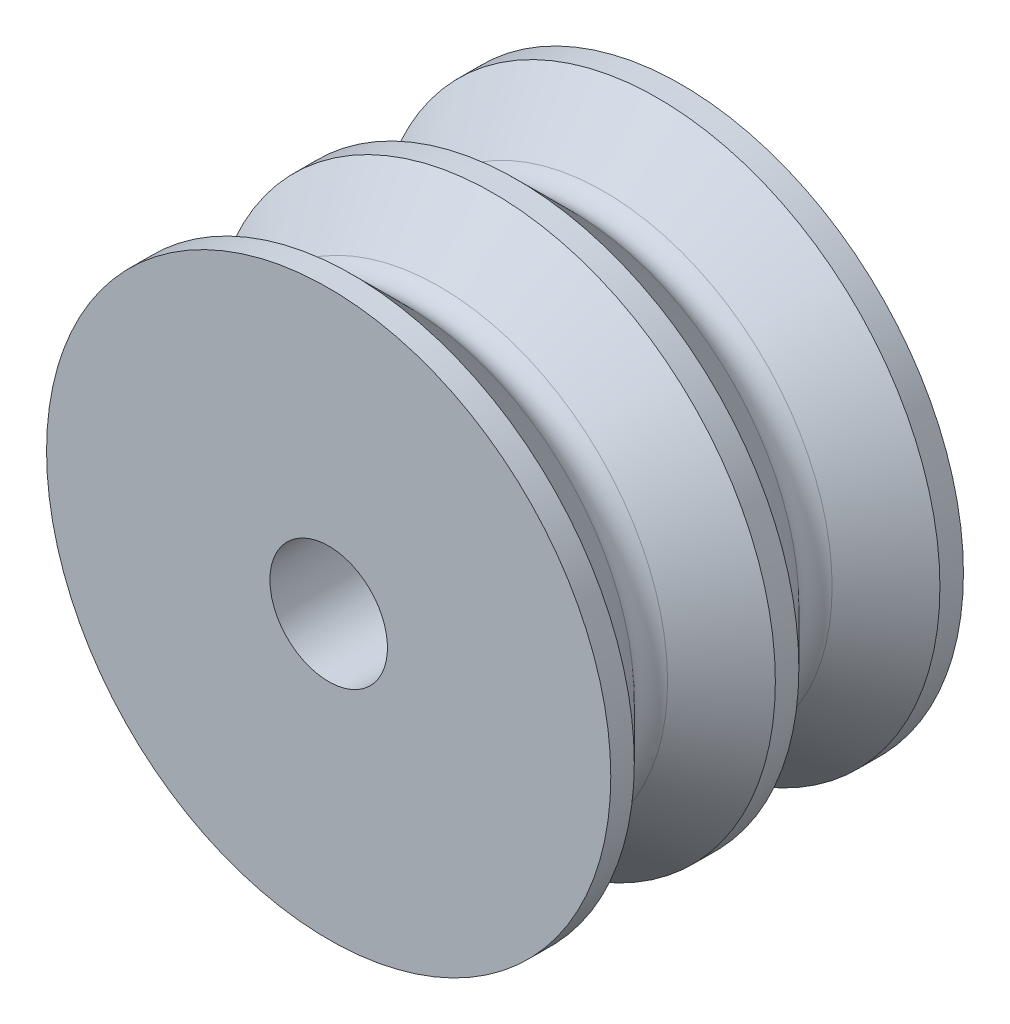
ISO-10303-21;
HEADER;
FILE_DESCRIPTION(('STEP AP214'),'2;1');
FILE_NAME('part.step','',(''),(''),'','','');
FILE_SCHEMA(('AUTOMOTIVE_DESIGN { 1 0 10303 214 1 1 1 1 }'));
ENDSEC;
DATA;
#1=APPLICATION_CONTEXT('core data for automotive mechanical design processes');
#2=APPLICATION_PROTOCOL_DEFINITION('international standard','automotive_design',2000,#1);
#3=PRODUCT_CONTEXT('',#1,'mechanical');
#4=PRODUCT('Part','Part','',(#3));
#5=PRODUCT_RELATED_PRODUCT_CATEGORY('part','',(#4));
#6=PRODUCT_DEFINITION_FORMATION('','',#4);
#7=PRODUCT_DEFINITION_CONTEXT('part definition',#1,'design');
#8=PRODUCT_DEFINITION('design','',#6,#7);
#9=PRODUCT_DEFINITION_SHAPE('','',#8);
#10=(LENGTH_UNIT() NAMED_UNIT(*) SI_UNIT(.MILLI.,.METRE.));
#11=(NAMED_UNIT(*) PLANE_ANGLE_UNIT() SI_UNIT($,.RADIAN.));
#12=(NAMED_UNIT(*) SI_UNIT($,.STERADIAN.) SOLID_ANGLE_UNIT());
#13=UNCERTAINTY_MEASURE_WITH_UNIT(LENGTH_MEASURE(1.E-05),#10,'distance_accuracy_value','');
#14=(GEOMETRIC_REPRESENTATION_CONTEXT(3) GLOBAL_UNCERTAINTY_ASSIGNED_CONTEXT((#13)) GLOBAL_UNIT_ASSIGNED_CONTEXT((#10,
#11,#12)) REPRESENTATION_CONTEXT('',''));
#15=CARTESIAN_POINT('',(0.,0.,0.));
#16=DIRECTION('',(0.,0.,1.));
#17=DIRECTION('',(1.,0.,0.));
#18=AXIS2_PLACEMENT_3D('',#15,#16,#17);
#19=CARTESIAN_POINT('',(-3.46389583683049E-13,-148.999797701156,372.300000000001));
#20=DIRECTION('',(0.,0.,1.));
#21=DIRECTION('',(1.,0.,0.));
#22=AXIS2_PLACEMENT_3D('',#19,#20,#21);
#23=PLANE('',#22);
#24=CARTESIAN_POINT('',(-3.46389583683049E-13,-148.999797701156,372.300000000001));
#25=DIRECTION('',(0.,0.,-1.));
#26=DIRECTION('',(-1.,0.,0.));
#27=AXIS2_PLACEMENT_3D('',#24,#25,#26);
#28=CIRCLE('',#27,0.999999999999995);
#29=CARTESIAN_POINT('',(-0.785683126104291,-148.381168551054,372.300000000001));
#30=VERTEX_POINT('',#29);
#31=CARTESIAN_POINT('',(0.785683126103598,-148.381168551054,372.300000000001));
#32=VERTEX_POINT('',#31);
#33=EDGE_CURVE('E55',#30,#32,#28,.T.);
#34=ORIENTED_EDGE('',*,*,#33,.T.);
#35=CARTESIAN_POINT('',(-3.46389583683049E-13,-138.999797701156,372.300000000001));
#36=DIRECTION('',(0.,0.,1.));
#37=DIRECTION('',(1.,0.,0.));
#38=AXIS2_PLACEMENT_3D('',#35,#36,#37);
#39=CIRCLE('',#38,9.4142135623731);
#40=EDGE_CURVE('E17',#30,#32,#39,.T.);
#41=ORIENTED_EDGE('',*,*,#40,.F.);
#42=EDGE_LOOP('',(#34,#41));
#43=FACE_BOUND('',#42,.T.);
#44=ADVANCED_FACE('F14',(#43),#23,.F.);
#45=CARTESIAN_POINT('',(-3.46389583683049E-13,-148.999797701156,365.300000000001));
#46=DIRECTION('',(0.,0.,1.));
#47=DIRECTION('',(1.,0.,0.));
#48=AXIS2_PLACEMENT_3D('',#45,#46,#47);
#49=PLANE('',#48);
#50=CARTESIAN_POINT('',(-3.46389583683049E-13,-138.999797701156,365.300000000001));
#51=DIRECTION('',(0.,0.,-1.));
#52=DIRECTION('',(-1.,0.,0.));
#53=AXIS2_PLACEMENT_3D('',#50,#51,#52);
#54=CIRCLE('',#53,9.4142135623731);
#55=CARTESIAN_POINT('',(-0.785683126104402,-148.381168551054,365.300000000001));
#56=VERTEX_POINT('',#55);
#57=CARTESIAN_POINT('',(0.785683126103598,-148.381168551054,365.300000000001));
#58=VERTEX_POINT('',#57);
#59=EDGE_CURVE('E50',#56,#58,#54,.F.);
#60=ORIENTED_EDGE('',*,*,#59,.T.);
#61=CARTESIAN_POINT('',(-3.46389583683049E-13,-148.999797701156,365.300000000001));
#62=DIRECTION('',(0.,0.,-1.));
#63=DIRECTION('',(-1.,0.,0.));
#64=AXIS2_PLACEMENT_3D('',#61,#62,#63);
#65=CIRCLE('',#64,0.999999999999995);
#66=EDGE_CURVE('E53',#58,#56,#65,.F.);
#67=ORIENTED_EDGE('',*,*,#66,.T.);
#68=EDGE_LOOP('',(#60,#67));
#69=FACE_BOUND('',#68,.T.);
#70=ADVANCED_FACE('F52',(#69),#49,.T.);
#71=CARTESIAN_POINT('',(-3.46077333457373E-13,-138.999797701156,369.300000000001));
#72=DIRECTION('',(0.,0.,-1.));
#73=DIRECTION('',(-1.,0.,0.));
#74=AXIS2_PLACEMENT_3D('',#71,#72,#73);
#75=CONICAL_SURFACE('',#74,12.,0.785398163397456);
#76=CARTESIAN_POINT('',(-3.46389583683049E-13,-138.999797701156,369.300000000001));
#77=DIRECTION('',(0.,0.,1.));
#78=DIRECTION('',(1.,0.,0.));
#79=AXIS2_PLACEMENT_3D('',#76,#77,#78);
#80=CIRCLE('',#79,12.);
#81=CARTESIAN_POINT('',(11.9999999999997,-138.999797701156,369.300000000001));
#82=VERTEX_POINT('',#81);
#83=EDGE_CURVE('E123',#82,#82,#80,.F.);
#84=ORIENTED_EDGE('',*,*,#83,.F.);
#85=EDGE_LOOP('',(#84));
#86=FACE_BOUND('',#85,.T.);
#87=CARTESIAN_POINT('',(0.940929009533424,-148.661193804224,371.592893218815));
#88=CARTESIAN_POINT('',(0.950761675392865,-148.688529687142,371.564732031432));
#89=CARTESIAN_POINT('',(0.959355090491101,-148.716135294409,371.536416572957));
#90=CARTESIAN_POINT('',(0.97408392329677,-148.771782886139,371.47958712578));
#91=CARTESIAN_POINT('',(0.980219849285714,-148.799824779118,371.451073179374));
#92=CARTESIAN_POINT('',(0.995025110040918,-148.884740782645,371.365104287514));
#93=CARTESIAN_POINT('',(0.999997028279216,-148.942138636444,371.30749700576));
#94=CARTESIAN_POINT('',(1.00000385578815,-149.07460997374,371.175683757575));
#95=CARTESIAN_POINT('',(0.99164254044308,-149.149861992266,371.101638175359));
#96=CARTESIAN_POINT('',(0.957234282382609,-149.299043058799,370.956395365391));
#97=CARTESIAN_POINT('',(0.931215074885569,-149.372973995201,370.885193855892));
#98=CARTESIAN_POINT('',(0.870678942944549,-149.494817621206,370.768965000672));
#99=CARTESIAN_POINT('',(0.841100603583893,-149.543845625449,370.722526376953));
#100=CARTESIAN_POINT('',(0.771855551009822,-149.63827777527,370.633624631573));
#101=CARTESIAN_POINT('',(0.732204389963432,-149.683687366865,370.591155518134));
#102=CARTESIAN_POINT('',(0.652676077545911,-149.758929039869,370.521152201862));
#103=CARTESIAN_POINT('',(0.614961785277175,-149.789937928269,370.492432925167));
#104=CARTESIAN_POINT('',(0.533236813824736,-149.847228845348,370.439552517499));
#105=CARTESIAN_POINT('',(0.489233917149894,-149.873516627244,370.415385836874));
#106=CARTESIAN_POINT('',(0.403991039101225,-149.915559197236,370.376835028246));
#107=CARTESIAN_POINT('',(0.363714582857212,-149.932360862634,370.361470328566));
#108=CARTESIAN_POINT('',(0.279930645422418,-149.960834504052,370.335470556928));
#109=CARTESIAN_POINT('',(0.236425090877602,-149.972509510592,370.324832690755));
#110=CARTESIAN_POINT('',(0.147014507445305,-149.989985308305,370.308921005338));
#111=CARTESIAN_POINT('',(0.101097420491732,-149.995752883759,370.303677516342));
#112=CARTESIAN_POINT('',(0.00861514879702178,-150.000831039736,370.299060362058));
#113=CARTESIAN_POINT('',(-0.0379498280568912,-150.000143645825,370.299684855399));
#114=CARTESIAN_POINT('',(-0.125764994496966,-149.99274433444,370.306413635611));
#115=CARTESIAN_POINT('',(-0.167105725796102,-149.986600461235,370.312001246583));
#116=CARTESIAN_POINT('',(-0.247887607092078,-149.969466390868,370.32760581542));
#117=CARTESIAN_POINT('',(-0.287328595238057,-149.95847578159,370.337623149942));
#118=CARTESIAN_POINT('',(-0.365027953774319,-149.931736879088,370.362041454038));
#119=CARTESIAN_POINT('',(-0.403175767493253,-149.915815732658,370.37660186211));
#120=CARTESIAN_POINT('',(-0.476000591185597,-149.880178549059,370.409275300227));
#121=CARTESIAN_POINT('',(-0.51067564322595,-149.860460389249,370.427390317509));
#122=CARTESIAN_POINT('',(-0.591934999932369,-149.80784557463,370.475870172796));
#123=CARTESIAN_POINT('',(-0.636328263729549,-149.773144495733,370.507960713314));
#124=CARTESIAN_POINT('',(-0.716914996099688,-149.699112690724,370.576777926564));
#125=CARTESIAN_POINT('',(-0.75309023809793,-149.659771962188,370.613514628563));
#126=CARTESIAN_POINT('',(-0.828719700674534,-149.563834224479,370.703614290354));
#127=CARTESIAN_POINT('',(-0.864966272956031,-149.505981495431,370.758327341144));
#128=CARTESIAN_POINT('',(-0.924248808261542,-149.387319345819,370.871498182804));
#129=CARTESIAN_POINT('',(-0.947269293385065,-149.32650655109,370.92996027247));
#130=CARTESIAN_POINT('',(-0.981479395886536,-149.202173816975,371.05054892856));
#131=CARTESIAN_POINT('',(-0.992361541863812,-149.138624140498,371.112730412019));
#132=CARTESIAN_POINT('',(-1.0019495264297,-149.011713984346,371.238079262454));
#133=CARTESIAN_POINT('',(-1.00066720235403,-148.948353380746,371.301245611287));
#134=CARTESIAN_POINT('',(-0.989089914093273,-148.847576817276,371.402674351908));
#135=CARTESIAN_POINT('',(-0.982529952804783,-148.80973866182,371.440980396663));
#136=CARTESIAN_POINT('',(-0.965022107847766,-148.734839164906,371.517245322683));
#137=CARTESIAN_POINT('',(-0.954079997857527,-148.697776868566,371.555204593791));
#138=CARTESIAN_POINT('',(-0.94092900953411,-148.661193804224,371.592893218815));
#139=B_SPLINE_CURVE_WITH_KNOTS('',3,(#87,#88,#89,#90,#91,#92,#93,#94,#95,#96,#97,#98,#99,#100,
#101,#102,#103,#104,#105,#106,#107,#108,#109,#110,#111,#112,#113,#114,#115,#116,#117,#118,#119,
#120,#121,#122,#123,#124,#125,#126,#127,#128,#129,#130,#131,#132,#133,#134,#135,#136,#137,#138),
.UNSPECIFIED.,.F.,.F.,(4,2,2,2,2,2,2,2,2,2,2,2,2,2,2,2,2,2,2,2,2,2,2,2,2,4),(0.,
0.121337554242991,0.242649999310827,0.486449885995278,0.802778700182797,1.11861180373739,
1.33907350062906,1.55919685769016,1.72853312592707,1.89766161691543,2.03589637528567,
2.17404930863967,2.31297483974015,2.45185677751494,2.5777816504887,2.7037172328731,
2.83469448688109,2.96574517462838,3.15919654454997,3.35307286599085,3.61413207867231,
3.87549617828409,4.14334024112838,4.41092368969288,4.57348085862604,4.73582455209721),.UNSPECIFIED.);
#140=CARTESIAN_POINT('',(0.940929009533424,-148.661193804224,371.592893218815));
#141=VERTEX_POINT('',#140);
#142=CARTESIAN_POINT('',(-0.940929009534115,-148.661193804224,371.592893218815));
#143=VERTEX_POINT('',#142);
#144=EDGE_CURVE('E113',#141,#143,#139,.T.);
#145=ORIENTED_EDGE('',*,*,#144,.T.);
#146=CARTESIAN_POINT('',(-3.46389583683049E-13,-138.999797701156,371.592893218814));
#147=DIRECTION('',(0.,0.,1.));
#148=DIRECTION('',(1.,0.,0.));
#149=AXIS2_PLACEMENT_3D('',#146,#147,#148);
#150=CIRCLE('',#149,9.7071067811867);
#151=EDGE_CURVE('E128',#143,#141,#150,.F.);
#152=ORIENTED_EDGE('',*,*,#151,.T.);
#153=EDGE_LOOP('',(#145,#152));
#154=FACE_BOUND('',#153,.T.);
#155=ADVANCED_FACE('F84',(#86,#154),#75,.T.);
#156=CARTESIAN_POINT('',(-3.46389583683049E-13,-148.999797701156,372.300000000001));
#157=DIRECTION('',(0.,0.,-1.));
#158=DIRECTION('',(-1.,0.,0.));
#159=AXIS2_PLACEMENT_3D('',#156,#157,#158);
#160=CYLINDRICAL_SURFACE('',#159,0.999999999999995);
#161=CARTESIAN_POINT('',(0.940929009533443,-148.661193804224,366.007106781187));
#162=CARTESIAN_POINT('',(0.926883709354368,-148.622150289799,365.966832439179));
#163=CARTESIAN_POINT('',(0.91145883494165,-148.586926220898,365.923469832014));
#164=CARTESIAN_POINT('',(0.880335427305401,-148.524146046362,365.831024260784));
#165=CARTESIAN_POINT('',(0.864635687156067,-148.496655223322,365.781897283122));
#166=CARTESIAN_POINT('',(0.835742161576531,-148.449984724785,365.678986664981));
#167=CARTESIAN_POINT('',(0.822552338823051,-148.43081813147,365.625195852909));
#168=CARTESIAN_POINT('',(0.806745142498376,-148.40883097876,365.542166697916));
#169=CARTESIAN_POINT('',(0.802144873469815,-148.402635404524,365.514164974212));
#170=CARTESIAN_POINT('',(0.794528147312913,-148.392536789393,365.457546772127));
#171=CARTESIAN_POINT('',(0.791510419104069,-148.388631908336,365.428930806389));
#172=CARTESIAN_POINT('',(0.788162841144473,-148.384327899717,365.383538788214));
#173=CARTESIAN_POINT('',(0.787235969201857,-148.38314452185,365.36687547721));
#174=CARTESIAN_POINT('',(0.785994872765981,-148.381564360598,365.333476026166));
#175=CARTESIAN_POINT('',(0.785681122688077,-148.381168186322,365.316739839764));
#176=CARTESIAN_POINT('',(0.78568312610372,-148.381168551054,365.300000000001));
#177=B_SPLINE_CURVE_WITH_KNOTS('',3,(#161,#162,#163,#164,#165,#166,#167,#168,#169,#170,#171,
#172,#173,#174,#175,#176),.UNSPECIFIED.,.F.,.F.,(4,2,2,2,2,2,2,4),(0.,0.173127550056504,
0.347675519323862,0.522496820483225,0.609519506841121,0.696472190005055,0.746638274867311,
0.796843161399259),.UNSPECIFIED.);
#178=CARTESIAN_POINT('',(0.940929009533437,-148.661193804224,366.007106781187));
#179=VERTEX_POINT('',#178);
#180=EDGE_CURVE('E60',#179,#58,#177,.T.);
#181=ORIENTED_EDGE('',*,*,#180,.F.);
#182=CARTESIAN_POINT('',(-0.94092900953413,-148.661193804224,366.007106781187));
#183=CARTESIAN_POINT('',(-0.954347715667033,-148.69852111398,366.045562704518));
#184=CARTESIAN_POINT('',(-0.965469088084749,-148.73635745241,366.084309889646));
#185=CARTESIAN_POINT('',(-0.983143923196795,-148.812785582511,366.162112310833));
#186=CARTESIAN_POINT('',(-0.989696761946402,-148.851377476633,366.201167588234));
#187=CARTESIAN_POINT('',(-0.998309283965094,-148.929512329982,366.279772440983));
#188=CARTESIAN_POINT('',(-1.00031379935502,-148.969061146228,366.31932229459));
#189=CARTESIAN_POINT('',(-0.999606776015449,-149.048358180153,366.398156597143));
#190=CARTESIAN_POINT('',(-0.996895376483,-149.088106391912,366.437441053889));
#191=CARTESIAN_POINT('',(-0.981538093719977,-149.207131112494,366.554399700902));
#192=CARTESIAN_POINT('',(-0.96168702488478,-149.286345267606,366.631337571493));
#193=CARTESIAN_POINT('',(-0.901163045268591,-149.441116828029,366.780069592838));
#194=CARTESIAN_POINT('',(-0.860603557213273,-149.516691723927,366.851889359362));
#195=CARTESIAN_POINT('',(-0.778759516087473,-149.629164097788,366.957806649673));
#196=CARTESIAN_POINT('',(-0.745147744275683,-149.668820698825,366.994938069578));
#197=CARTESIAN_POINT('',(-0.669974609102645,-149.744078896914,367.065075158609));
#198=CARTESIAN_POINT('',(-0.62842423763797,-149.779685993472,367.098086429269));
#199=CARTESIAN_POINT('',(-0.546181924769867,-149.838680343167,367.15256874627));
#200=CARTESIAN_POINT('',(-0.506894651801295,-149.863097354766,367.175035560984));
#201=CARTESIAN_POINT('',(-0.423400088679092,-149.906964567667,367.215298553088));
#202=CARTESIAN_POINT('',(-0.379194376228135,-149.926416355122,367.233096222099));
#203=CARTESIAN_POINT('',(-0.286226804794715,-149.959237054159,367.263075140686));
#204=CARTESIAN_POINT('',(-0.237426158188697,-149.972547300032,367.275202237495));
#205=CARTESIAN_POINT('',(-0.137203134551678,-149.991648040338,367.292592315137));
#206=CARTESIAN_POINT('',(-0.0857839692828148,-149.997447526764,367.297863503997));
#207=CARTESIAN_POINT('',(0.00959293654608934,-150.000711283087,367.300830483322));
#208=CARTESIAN_POINT('',(0.0534848879460306,-149.999318018394,367.299564586118));
#209=CARTESIAN_POINT('',(0.140251778159038,-149.990871793788,367.291883215122));
#210=CARTESIAN_POINT('',(0.183126837361079,-149.983819507319,367.285468354076));
#211=CARTESIAN_POINT('',(0.265146082242642,-149.964891999084,367.268224829307));
#212=CARTESIAN_POINT('',(0.304369097737182,-149.953200248223,367.257564021393));
#213=CARTESIAN_POINT('',(0.380004575166224,-149.925659020043,367.232400680225));
#214=CARTESIAN_POINT('',(0.416415908205089,-149.909807883841,367.217896614147));
#215=CARTESIAN_POINT('',(0.499228654246996,-149.867936601169,367.179488529278));
#216=CARTESIAN_POINT('',(0.544152507727985,-149.840342843106,367.154108392783));
#217=CARTESIAN_POINT('',(0.627308151134354,-149.780264577964,367.09861616465));
#218=CARTESIAN_POINT('',(0.665527056454635,-149.747770872839,367.068495168846));
#219=CARTESIAN_POINT('',(0.747078967657973,-149.667739756614,366.993953890541));
#220=CARTESIAN_POINT('',(0.787782111803403,-149.61882716336,366.948139297419));
#221=CARTESIAN_POINT('',(0.857942301919493,-149.517250170763,366.852315351044));
#222=CARTESIAN_POINT('',(0.887382824396402,-149.46458039251,366.802299964872));
#223=CARTESIAN_POINT('',(0.941712151317103,-149.344099012949,366.687015766211));
#224=CARTESIAN_POINT('',(0.963748130131547,-149.275722668596,366.620997733112));
#225=CARTESIAN_POINT('',(0.992897874547776,-149.138042286368,366.486727204571));
#226=CARTESIAN_POINT('',(1.00000238112333,-149.068737699677,366.418473349316));
#227=CARTESIAN_POINT('',(0.999998010314247,-148.942190904212,366.292554827915));
#228=CARTESIAN_POINT('',(0.995033705157264,-148.88483867742,366.234993928755));
#229=CARTESIAN_POINT('',(0.980244706657838,-148.799943222048,366.14904717611));
#230=CARTESIAN_POINT('',(0.974106564144299,-148.771876494231,366.120508277768));
#231=CARTESIAN_POINT('',(0.959369359356026,-148.716181174648,366.063630474318));
#232=CARTESIAN_POINT('',(0.950769899735304,-148.688552654384,366.035291602259));
#233=CARTESIAN_POINT('',(0.940929009533457,-148.661193804224,366.007106781187));
#234=B_SPLINE_CURVE_WITH_KNOTS('',3,(#182,#183,#184,#185,#186,#187,#188,#189,#190,#191,#192,
#193,#194,#195,#196,#197,#198,#199,#200,#201,#202,#203,#204,#205,#206,#207,#208,#209,#210,#211,
#212,#213,#214,#215,#216,#217,#218,#219,#220,#221,#222,#223,#224,#225,#226,#227,#228,#229,#230,
#231,#232,#233),.UNSPECIFIED.,.F.,.F.,(4,2,2,2,2,2,2,2,2,2,2,2,2,2,2,2,2,2,2,2,2,2,2,2,2,4),(0.,
0.165672953402738,0.33136852905875,0.499063367870423,0.666753257010636,1.0014693617266,
1.33437154080395,1.5254259755397,1.71621776599691,1.86990339386423,2.02353986488839,
2.17861498877713,2.33350428226033,2.46462613556774,2.59573238719419,2.72210146602449,
2.848521021275,3.0230941387371,3.19799913613853,3.43195569318848,3.66625418557058,
3.95759055997536,4.2491075392233,4.4927013860476,4.61411974271113,4.73555771177446),.UNSPECIFIED.);
#235=CARTESIAN_POINT('',(-0.940929009534124,-148.661193804224,366.007106781187));
#236=VERTEX_POINT('',#235);
#237=EDGE_CURVE('E90',#236,#179,#234,.T.);
#238=ORIENTED_EDGE('',*,*,#237,.F.);
#239=CARTESIAN_POINT('',(-0.78568312610441,-148.381168551054,365.300000000001));
#240=CARTESIAN_POINT('',(-0.785667766290702,-148.381164078107,365.326395977496));
#241=CARTESIAN_POINT('',(-0.786457490231267,-148.382152221361,365.352784239468));
#242=CARTESIAN_POINT('',(-0.789530080556326,-148.386076799137,365.405300643787));
#243=CARTESIAN_POINT('',(-0.79181134920037,-148.389011148934,365.431429034136));
#244=CARTESIAN_POINT('',(-0.797733861309024,-148.396769588373,365.483093541654));
#245=CARTESIAN_POINT('',(-0.801367429005967,-148.401583019592,365.508632153648));
#246=CARTESIAN_POINT('',(-0.809796473874436,-148.413043658208,365.55909658097));
#247=CARTESIAN_POINT('',(-0.814592206225365,-148.419691268386,365.58402226039));
#248=CARTESIAN_POINT('',(-0.830340394194728,-148.442239419262,365.65746889765));
#249=CARTESIAN_POINT('',(-0.8426856210992,-148.460782593876,365.70490342352));
#250=CARTESIAN_POINT('',(-0.869136809921091,-148.504567208218,365.796050556818));
#251=CARTESIAN_POINT('',(-0.883243915471095,-148.529813010705,365.839760715478));
#252=CARTESIAN_POINT('',(-0.904792281683901,-148.573601544629,365.903610263126));
#253=CARTESIAN_POINT('',(-0.912304856301952,-148.589859763709,365.925316991177));
#254=CARTESIAN_POINT('',(-0.926960994722009,-148.62417779054,365.967296290761));
#255=CARTESIAN_POINT('',(-0.934105385413611,-148.642233268004,365.987572117486));
#256=CARTESIAN_POINT('',(-0.94092900953417,-148.661193804224,366.007106781187));
#257=B_SPLINE_CURVE_WITH_KNOTS('',3,(#239,#240,#241,#242,#243,#244,#245,#246,#247,#248,#249,
#250,#251,#252,#253,#254,#255,#256),.UNSPECIFIED.,.F.,.F.,(4,2,2,2,2,2,2,2,4),(0.,
0.0791451604467448,0.158205679311439,0.236824123017362,0.315459844837883,0.471994051117499,
0.628630396778435,0.71296895547164,0.797109014644043),.UNSPECIFIED.);
#258=EDGE_CURVE('E32',#56,#236,#257,.T.);
#259=ORIENTED_EDGE('',*,*,#258,.F.);
#260=ORIENTED_EDGE('',*,*,#66,.F.);
#261=EDGE_LOOP('',(#181,#238,#259,#260));
#262=FACE_BOUND('',#261,.T.);
#263=ORIENTED_EDGE('',*,*,#144,.F.);
#264=CARTESIAN_POINT('',(0.940929009533425,-148.661193804224,371.592893218815));
#265=CARTESIAN_POINT('',(0.926883709354339,-148.622150289799,371.633167560823));
#266=CARTESIAN_POINT('',(0.911458834941624,-148.586926220898,371.676530167988));
#267=CARTESIAN_POINT('',(0.880335427305388,-148.524146046362,371.768975739218));
#268=CARTESIAN_POINT('',(0.864635687156064,-148.496655223322,371.81810271688));
#269=CARTESIAN_POINT('',(0.83574216157653,-148.449984724785,371.921013335021));
#270=CARTESIAN_POINT('',(0.822552338823041,-148.43081813147,371.974804147093));
#271=CARTESIAN_POINT('',(0.806745142498354,-148.40883097876,372.057833302086));
#272=CARTESIAN_POINT('',(0.802144873469789,-148.402635404524,372.08583502579));
#273=CARTESIAN_POINT('',(0.794528147312899,-148.392536789393,372.142453227875));
#274=CARTESIAN_POINT('',(0.791510419104071,-148.388631908336,372.171069193614));
#275=CARTESIAN_POINT('',(0.788162841144467,-148.384327899717,372.216461211788));
#276=CARTESIAN_POINT('',(0.78723596920184,-148.38314452185,372.233124522792));
#277=CARTESIAN_POINT('',(0.785994872765958,-148.381564360598,372.266523973836));
#278=CARTESIAN_POINT('',(0.785681122688059,-148.381168186322,372.283260160238));
#279=CARTESIAN_POINT('',(0.785683126103729,-148.381168551054,372.300000000001));
#280=B_SPLINE_CURVE_WITH_KNOTS('',3,(#264,#265,#266,#267,#268,#269,#270,#271,#272,#273,#274,
#275,#276,#277,#278,#279),.UNSPECIFIED.,.F.,.F.,(4,2,2,2,2,2,2,4),(0.,0.173127550056505,
0.347675519323845,0.522496820483211,0.609519506841107,0.696472190005036,0.746638274867293,
0.79684316139924),.UNSPECIFIED.);
#281=EDGE_CURVE('E107',#141,#32,#280,.T.);
#282=ORIENTED_EDGE('',*,*,#281,.T.);
#283=ORIENTED_EDGE('',*,*,#33,.F.);
#284=CARTESIAN_POINT('',(-0.785683126104403,-148.381168551054,372.300000000001));
#285=CARTESIAN_POINT('',(-0.785667766290698,-148.381164078107,372.273604022506));
#286=CARTESIAN_POINT('',(-0.786457490231266,-148.382152221361,372.247215760534));
#287=CARTESIAN_POINT('',(-0.789530080556329,-148.386076799137,372.194699356215));
#288=CARTESIAN_POINT('',(-0.791811349200375,-148.389011148934,372.168570965866));
#289=CARTESIAN_POINT('',(-0.797733861309025,-148.396769588373,372.116906458348));
#290=CARTESIAN_POINT('',(-0.801367429005964,-148.401583019592,372.091367846354));
#291=CARTESIAN_POINT('',(-0.809796473874427,-148.413043658208,372.040903419032));
#292=CARTESIAN_POINT('',(-0.814592206225353,-148.419691268386,372.015977739612));
#293=CARTESIAN_POINT('',(-0.830340394194715,-148.442239419262,371.942531102352));
#294=CARTESIAN_POINT('',(-0.842685621099197,-148.460782593876,371.895096576482));
#295=CARTESIAN_POINT('',(-0.86913680992108,-148.504567208218,371.803949443184));
#296=CARTESIAN_POINT('',(-0.883243915471069,-148.529813010705,371.760239284524));
#297=CARTESIAN_POINT('',(-0.904792281683884,-148.573601544629,371.696389736876));
#298=CARTESIAN_POINT('',(-0.912304856301945,-148.589859763709,371.674683008825));
#299=CARTESIAN_POINT('',(-0.926960994722027,-148.62417779054,371.632703709241));
#300=CARTESIAN_POINT('',(-0.934105385413646,-148.642233268004,371.612427882516));
#301=CARTESIAN_POINT('',(-0.940929009534226,-148.661193804224,371.592893218815));
#302=B_SPLINE_CURVE_WITH_KNOTS('',3,(#284,#285,#286,#287,#288,#289,#290,#291,#292,#293,#294,
#295,#296,#297,#298,#299,#300,#301),.UNSPECIFIED.,.F.,.F.,(4,2,2,2,2,2,2,2,4),(0.,
0.079145160446745,0.158205679311439,0.236824123017361,0.315459844837881,0.471994051117437,
0.62863039677843,0.712968955471658,0.797109014644056),.UNSPECIFIED.);
#303=EDGE_CURVE('E100',#30,#143,#302,.T.);
#304=ORIENTED_EDGE('',*,*,#303,.T.);
#305=EDGE_LOOP('',(#263,#282,#283,#304));
#306=FACE_BOUND('',#305,.T.);
#307=ADVANCED_FACE('F58',(#262,#306),#160,.F.);
#308=CARTESIAN_POINT('',(-3.46389583683049E-13,-138.999797701156,368.800000000001));
#309=DIRECTION('',(0.,0.,1.));
#310=DIRECTION('',(1.,0.,0.));
#311=AXIS2_PLACEMENT_3D('',#308,#309,#310);
#312=CYLINDRICAL_SURFACE('',#311,12.);
#313=CARTESIAN_POINT('',(-3.46389583683049E-13,-138.999797701156,368.300000000001));
#314=DIRECTION('',(0.,0.,1.));
#315=DIRECTION('',(-1.,0.,0.));
#316=AXIS2_PLACEMENT_3D('',#313,#314,#315);
#317=CIRCLE('',#316,12.);
#318=CARTESIAN_POINT('',(-12.0000000000004,-138.999797701156,368.300000000001));
#319=VERTEX_POINT('',#318);
#320=EDGE_CURVE('E137',#319,#319,#317,.F.);
#321=ORIENTED_EDGE('',*,*,#320,.F.);
#322=EDGE_LOOP('',(#321));
#323=FACE_BOUND('',#322,.T.);
#324=ORIENTED_EDGE('',*,*,#83,.T.);
#325=EDGE_LOOP('',(#324));
#326=FACE_BOUND('',#325,.T.);
#327=ADVANCED_FACE('F83',(#323,#326),#312,.T.);
#328=CARTESIAN_POINT('',(-3.46389583683049E-13,-138.999797701156,372.300000000001));
#329=DIRECTION('',(0.,0.,1.));
#330=DIRECTION('',(1.,0.,0.));
#331=AXIS2_PLACEMENT_3D('',#328,#329,#330);
#332=TOROIDAL_SURFACE('',#331,10.4142135623731,1.);
#333=CARTESIAN_POINT('',(-3.46389583683049E-13,-138.999797701156,373.007106781187));
#334=DIRECTION('',(0.,0.,1.));
#335=DIRECTION('',(-1.,0.,0.));
#336=AXIS2_PLACEMENT_3D('',#333,#334,#335);
#337=CIRCLE('',#336,9.70710678118629);
#338=CARTESIAN_POINT('',(-9.70710678118663,-138.999797701156,373.007106781187));
#339=VERTEX_POINT('',#338);
#340=EDGE_CURVE('E139',#339,#339,#337,.T.);
#341=ORIENTED_EDGE('',*,*,#340,.F.);
#342=EDGE_LOOP('',(#341));
#343=FACE_BOUND('',#342,.T.);
#344=ORIENTED_EDGE('',*,*,#40,.T.);
#345=ORIENTED_EDGE('',*,*,#281,.F.);
#346=ORIENTED_EDGE('',*,*,#151,.F.);
#347=ORIENTED_EDGE('',*,*,#303,.F.);
#348=EDGE_LOOP('',(#344,#345,#346,#347));
#349=FACE_BOUND('',#348,.T.);
#350=ADVANCED_FACE('F164',(#343,#349),#332,.F.);
#351=CARTESIAN_POINT('',(-3.46077333457373E-13,-138.999797701156,368.300000000001));
#352=DIRECTION('',(0.,0.,1.));
#353=DIRECTION('',(1.,0.,0.));
#354=AXIS2_PLACEMENT_3D('',#351,#352,#353);
#355=CONICAL_SURFACE('',#354,12.,0.785398163397456);
#356=ORIENTED_EDGE('',*,*,#320,.T.);
#357=EDGE_LOOP('',(#356));
#358=FACE_BOUND('',#357,.T.);
#359=ORIENTED_EDGE('',*,*,#237,.T.);
#360=CARTESIAN_POINT('',(-3.46389583683049E-13,-138.999797701156,366.007106781187));
#361=DIRECTION('',(0.,0.,-1.));
#362=DIRECTION('',(-1.,0.,0.));
#363=AXIS2_PLACEMENT_3D('',#360,#361,#362);
#364=CIRCLE('',#363,9.70710678118628);
#365=EDGE_CURVE('E64',#179,#236,#364,.F.);
#366=ORIENTED_EDGE('',*,*,#365,.T.);
#367=EDGE_LOOP('',(#359,#366));
#368=FACE_BOUND('',#367,.T.);
#369=ADVANCED_FACE('F167',(#358,#368),#355,.T.);
#370=CARTESIAN_POINT('',(-3.46077333457373E-13,-138.999797701156,375.300000000001));
#371=DIRECTION('',(0.,0.,1.));
#372=DIRECTION('',(1.,0.,0.));
#373=AXIS2_PLACEMENT_3D('',#370,#371,#372);
#374=CONICAL_SURFACE('',#373,12.,0.785398163397454);
#375=CARTESIAN_POINT('',(-3.46389583683049E-13,-138.999797701156,375.300000000001));
#376=DIRECTION('',(0.,0.,-1.));
#377=DIRECTION('',(-1.,0.,0.));
#378=AXIS2_PLACEMENT_3D('',#375,#376,#377);
#379=CIRCLE('',#378,12.);
#380=CARTESIAN_POINT('',(-12.0000000000003,-138.999797701156,375.300000000001));
#381=VERTEX_POINT('',#380);
#382=EDGE_CURVE('E154',#381,#381,#379,.F.);
#383=ORIENTED_EDGE('',*,*,#382,.F.);
#384=EDGE_LOOP('',(#383));
#385=FACE_BOUND('',#384,.T.);
#386=ORIENTED_EDGE('',*,*,#340,.T.);
#387=EDGE_LOOP('',(#386));
#388=FACE_BOUND('',#387,.T.);
#389=ADVANCED_FACE('F172',(#385,#388),#374,.T.);
#390=CARTESIAN_POINT('',(-3.46389583683049E-13,-138.999797701156,365.300000000001));
#391=DIRECTION('',(0.,0.,-1.));
#392=DIRECTION('',(-1.,0.,0.));
#393=AXIS2_PLACEMENT_3D('',#390,#391,#392);
#394=TOROIDAL_SURFACE('',#393,10.4142135623731,1.);
#395=CARTESIAN_POINT('',(-3.46389583683049E-13,-138.999797701156,364.592893218814));
#396=DIRECTION('',(0.,0.,-1.));
#397=DIRECTION('',(-1.,0.,0.));
#398=AXIS2_PLACEMENT_3D('',#395,#396,#397);
#399=CIRCLE('',#398,9.70710678118673);
#400=CARTESIAN_POINT('',(-9.70710678118708,-138.999797701156,364.592893218814));
#401=VERTEX_POINT('',#400);
#402=EDGE_CURVE('E148',#401,#401,#399,.T.);
#403=ORIENTED_EDGE('',*,*,#402,.F.);
#404=EDGE_LOOP('',(#403));
#405=FACE_BOUND('',#404,.T.);
#406=ORIENTED_EDGE('',*,*,#59,.F.);
#407=ORIENTED_EDGE('',*,*,#258,.T.);
#408=ORIENTED_EDGE('',*,*,#365,.F.);
#409=ORIENTED_EDGE('',*,*,#180,.T.);
#410=EDGE_LOOP('',(#406,#407,#408,#409));
#411=FACE_BOUND('',#410,.T.);
#412=ADVANCED_FACE('F62',(#405,#411),#394,.F.);
#413=CARTESIAN_POINT('',(-3.46389583683049E-13,-138.999797701156,376.300000000001));
#414=DIRECTION('',(0.,0.,-1.));
#415=DIRECTION('',(-1.,0.,0.));
#416=AXIS2_PLACEMENT_3D('',#413,#414,#415);
#417=CYLINDRICAL_SURFACE('',#416,12.);
#418=CARTESIAN_POINT('',(-3.46389583683049E-13,-138.999797701156,376.300000000001));
#419=DIRECTION('',(0.,0.,-1.));
#420=DIRECTION('',(-1.,0.,0.));
#421=AXIS2_PLACEMENT_3D('',#418,#419,#420);
#422=CIRCLE('',#421,12.);
#423=CARTESIAN_POINT('',(-12.0000000000003,-138.999797701156,376.300000000001));
#424=VERTEX_POINT('',#423);
#425=EDGE_CURVE('E146',#424,#424,#422,.F.);
#426=ORIENTED_EDGE('',*,*,#425,.F.);
#427=EDGE_LOOP('',(#426));
#428=FACE_BOUND('',#427,.T.);
#429=ORIENTED_EDGE('',*,*,#382,.T.);
#430=EDGE_LOOP('',(#429));
#431=FACE_BOUND('',#430,.T.);
#432=ADVANCED_FACE('F180',(#428,#431),#417,.T.);
#433=CARTESIAN_POINT('',(-3.46077333457373E-13,-138.999797701156,362.300000000001));
#434=DIRECTION('',(0.,0.,-1.));
#435=DIRECTION('',(0.,1.,0.));
#436=AXIS2_PLACEMENT_3D('',#433,#434,#435);
#437=CONICAL_SURFACE('',#436,12.,0.785398163397453);
#438=CARTESIAN_POINT('',(-3.46389583683049E-13,-138.999797701156,362.300000000001));
#439=DIRECTION('',(0.,0.,1.));
#440=DIRECTION('',(1.,0.,0.));
#441=AXIS2_PLACEMENT_3D('',#438,#439,#440);
#442=CIRCLE('',#441,12.);
#443=CARTESIAN_POINT('',(11.9999999999997,-138.999797701156,362.300000000001));
#444=VERTEX_POINT('',#443);
#445=EDGE_CURVE('E145',#444,#444,#442,.F.);
#446=ORIENTED_EDGE('',*,*,#445,.F.);
#447=EDGE_LOOP('',(#446));
#448=FACE_BOUND('',#447,.T.);
#449=ORIENTED_EDGE('',*,*,#402,.T.);
#450=EDGE_LOOP('',(#449));
#451=FACE_BOUND('',#450,.T.);
#452=ADVANCED_FACE('F204',(#448,#451),#437,.T.);
#453=CARTESIAN_POINT('',(-3.46389583683049E-13,-138.999797701156,376.300000000001));
#454=DIRECTION('',(0.,0.,1.));
#455=DIRECTION('',(1.,0.,0.));
#456=AXIS2_PLACEMENT_3D('',#453,#454,#455);
#457=PLANE('',#456);
#458=CARTESIAN_POINT('',(-3.46389583683049E-13,-138.999797701156,376.300000000001));
#459=DIRECTION('',(0.,0.,-1.));
#460=DIRECTION('',(-1.,0.,0.));
#461=AXIS2_PLACEMENT_3D('',#458,#459,#460);
#462=CIRCLE('',#461,2.5);
#463=CARTESIAN_POINT('',(-2.50000000000035,-138.999797701156,376.300000000001));
#464=VERTEX_POINT('',#463);
#465=EDGE_CURVE('E143',#464,#464,#462,.T.);
#466=ORIENTED_EDGE('',*,*,#465,.T.);
#467=EDGE_LOOP('',(#466));
#468=FACE_BOUND('',#467,.T.);
#469=ORIENTED_EDGE('',*,*,#425,.T.);
#470=EDGE_LOOP('',(#469));
#471=FACE_BOUND('',#470,.T.);
#472=ADVANCED_FACE('F200',(#468,#471),#457,.T.);
#473=CARTESIAN_POINT('',(-3.46389583683049E-13,-138.999797701156,361.300000000001));
#474=DIRECTION('',(0.,0.,1.));
#475=DIRECTION('',(1.,0.,0.));
#476=AXIS2_PLACEMENT_3D('',#473,#474,#475);
#477=CYLINDRICAL_SURFACE('',#476,12.);
#478=CARTESIAN_POINT('',(-3.46389583683049E-13,-138.999797701156,361.300000000001));
#479=DIRECTION('',(0.,0.,1.));
#480=DIRECTION('',(1.,0.,0.));
#481=AXIS2_PLACEMENT_3D('',#478,#479,#480);
#482=CIRCLE('',#481,12.);
#483=CARTESIAN_POINT('',(11.9999999999997,-138.999797701156,361.300000000001));
#484=VERTEX_POINT('',#483);
#485=EDGE_CURVE('E23',#484,#484,#482,.T.);
#486=ORIENTED_EDGE('',*,*,#485,.T.);
#487=EDGE_LOOP('',(#486));
#488=FACE_BOUND('',#487,.T.);
#489=ORIENTED_EDGE('',*,*,#445,.T.);
#490=EDGE_LOOP('',(#489));
#491=FACE_BOUND('',#490,.T.);
#492=ADVANCED_FACE('F192',(#488,#491),#477,.T.);
#493=CARTESIAN_POINT('',(-3.46389583683049E-13,-138.999797701156,368.800000000001));
#494=DIRECTION('',(0.,0.,-1.));
#495=DIRECTION('',(-1.,0.,0.));
#496=AXIS2_PLACEMENT_3D('',#493,#494,#495);
#497=CYLINDRICAL_SURFACE('',#496,2.5);
#498=ORIENTED_EDGE('',*,*,#465,.F.);
#499=EDGE_LOOP('',(#498));
#500=FACE_BOUND('',#499,.T.);
#501=CARTESIAN_POINT('',(-3.46389583683049E-13,-138.999797701156,361.300000000001));
#502=DIRECTION('',(0.,0.,-1.));
#503=DIRECTION('',(-1.,0.,0.));
#504=AXIS2_PLACEMENT_3D('',#501,#502,#503);
#505=CIRCLE('',#504,2.5);
#506=CARTESIAN_POINT('',(-2.50000000000035,-138.999797701156,361.300000000001));
#507=VERTEX_POINT('',#506);
#508=EDGE_CURVE('E9',#507,#507,#505,.T.);
#509=ORIENTED_EDGE('',*,*,#508,.T.);
#510=EDGE_LOOP('',(#509));
#511=FACE_BOUND('',#510,.T.);
#512=ADVANCED_FACE('F186',(#500,#511),#497,.F.);
#513=CARTESIAN_POINT('',(-3.46389583683049E-13,-138.999797701156,361.300000000001));
#514=DIRECTION('',(0.,0.,1.));
#515=DIRECTION('',(1.,0.,0.));
#516=AXIS2_PLACEMENT_3D('',#513,#514,#515);
#517=PLANE('',#516);
#518=ORIENTED_EDGE('',*,*,#508,.F.);
#519=EDGE_LOOP('',(#518));
#520=FACE_BOUND('',#519,.T.);
#521=ORIENTED_EDGE('',*,*,#485,.F.);
#522=EDGE_LOOP('',(#521));
#523=FACE_BOUND('',#522,.T.);
#524=ADVANCED_FACE('F184',(#520,#523),#517,.F.);
#525=CLOSED_SHELL('',(#44,#70,#155,#307,#327,#350,#369,#389,#412,#432,#452,#472,#492,#512,#524));
#526=MANIFOLD_SOLID_BREP('B1',#525);
#527=ADVANCED_BREP_SHAPE_REPRESENTATION('',(#18,#526),#14);
#528=SHAPE_DEFINITION_REPRESENTATION(#9,#527);
ENDSEC;
END-ISO-10303-21;
